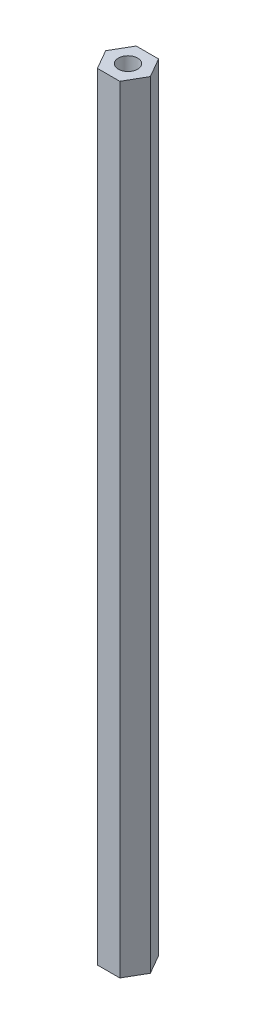
ISO-10303-21;
HEADER;
FILE_DESCRIPTION(('STEP AP214'),'2;1');
FILE_NAME('part.step','',(''),(''),'','','');
FILE_SCHEMA(('AUTOMOTIVE_DESIGN { 1 0 10303 214 1 1 1 1 }'));
ENDSEC;
DATA;
#1=APPLICATION_CONTEXT('core data for automotive mechanical design processes');
#2=APPLICATION_PROTOCOL_DEFINITION('international standard','automotive_design',2000,#1);
#3=PRODUCT_CONTEXT('',#1,'mechanical');
#4=PRODUCT('Part','Part','',(#3));
#5=PRODUCT_RELATED_PRODUCT_CATEGORY('part','',(#4));
#6=PRODUCT_DEFINITION_FORMATION('','',#4);
#7=PRODUCT_DEFINITION_CONTEXT('part definition',#1,'design');
#8=PRODUCT_DEFINITION('design','',#6,#7);
#9=PRODUCT_DEFINITION_SHAPE('','',#8);
#10=(LENGTH_UNIT() NAMED_UNIT(*) SI_UNIT(.MILLI.,.METRE.));
#11=(NAMED_UNIT(*) PLANE_ANGLE_UNIT() SI_UNIT($,.RADIAN.));
#12=(NAMED_UNIT(*) SI_UNIT($,.STERADIAN.) SOLID_ANGLE_UNIT());
#13=UNCERTAINTY_MEASURE_WITH_UNIT(LENGTH_MEASURE(1.E-05),#10,'distance_accuracy_value','');
#14=(GEOMETRIC_REPRESENTATION_CONTEXT(3) GLOBAL_UNCERTAINTY_ASSIGNED_CONTEXT((#13)) GLOBAL_UNIT_ASSIGNED_CONTEXT((#10,
#11,#12)) REPRESENTATION_CONTEXT('',''));
#15=CARTESIAN_POINT('',(0.,0.,0.));
#16=DIRECTION('',(0.,0.,1.));
#17=DIRECTION('',(1.,0.,0.));
#18=AXIS2_PLACEMENT_3D('',#15,#16,#17);
#19=CARTESIAN_POINT('',(1.44337567297409,50.1015,2.49999999999999));
#20=DIRECTION('',(-0.866025403784441,0.,-0.499999999999995));
#21=DIRECTION('',(-0.499999999999995,0.,0.866025403784441));
#22=AXIS2_PLACEMENT_3D('',#19,#20,#21);
#23=PLANE('',#22);
#24=DIRECTION('',(0.499999999999995,0.,-0.866025403784441));
#25=VECTOR('',#24,1.);
#26=CARTESIAN_POINT('',(1.44337567297409,-50.1015,2.49999999999999));
#27=LINE('',#26,#25);
#28=CARTESIAN_POINT('',(1.44337567297409,-50.1015,2.49999999999999));
#29=VERTEX_POINT('',#28);
#30=CARTESIAN_POINT('',(2.88675134594813,-50.1015,0.));
#31=VERTEX_POINT('',#30);
#32=EDGE_CURVE('E136',#29,#31,#27,.T.);
#33=ORIENTED_EDGE('',*,*,#32,.T.);
#34=DIRECTION('',(0.,-1.,0.));
#35=VECTOR('',#34,1.);
#36=CARTESIAN_POINT('',(2.88675134594813,50.1015,0.));
#37=LINE('',#36,#35);
#38=CARTESIAN_POINT('',(2.88675134594813,50.1015,0.));
#39=VERTEX_POINT('',#38);
#40=EDGE_CURVE('E11',#39,#31,#37,.T.);
#41=ORIENTED_EDGE('',*,*,#40,.F.);
#42=DIRECTION('',(0.499999999999995,0.,-0.866025403784441));
#43=VECTOR('',#42,1.);
#44=CARTESIAN_POINT('',(1.44337567297409,50.1015,2.49999999999999));
#45=LINE('',#44,#43);
#46=CARTESIAN_POINT('',(1.44337567297409,50.1015,2.49999999999999));
#47=VERTEX_POINT('',#46);
#48=EDGE_CURVE('E147',#47,#39,#45,.T.);
#49=ORIENTED_EDGE('',*,*,#48,.F.);
#50=DIRECTION('',(0.,-1.,0.));
#51=VECTOR('',#50,1.);
#52=CARTESIAN_POINT('',(1.44337567297409,50.1015,2.49999999999999));
#53=LINE('',#52,#51);
#54=EDGE_CURVE('E132',#47,#29,#53,.T.);
#55=ORIENTED_EDGE('',*,*,#54,.T.);
#56=EDGE_LOOP('',(#33,#41,#49,#55));
#57=FACE_BOUND('',#56,.T.);
#58=ADVANCED_FACE('F49',(#57),#23,.F.);
#59=CARTESIAN_POINT('',(2.88675134594813,50.1015,0.));
#60=DIRECTION('',(-0.866025403784438,0.,0.500000000000001));
#61=DIRECTION('',(0.500000000000001,0.,0.866025403784438));
#62=AXIS2_PLACEMENT_3D('',#59,#60,#61);
#63=PLANE('',#62);
#64=DIRECTION('',(-0.500000000000001,0.,-0.866025403784438));
#65=VECTOR('',#64,1.);
#66=CARTESIAN_POINT('',(2.88675134594813,-50.1015,0.));
#67=LINE('',#66,#65);
#68=CARTESIAN_POINT('',(1.44337567297406,-50.1015,-2.50000000000001));
#69=VERTEX_POINT('',#68);
#70=EDGE_CURVE('E139',#31,#69,#67,.T.);
#71=ORIENTED_EDGE('',*,*,#70,.T.);
#72=DIRECTION('',(0.,-1.,0.));
#73=VECTOR('',#72,1.);
#74=CARTESIAN_POINT('',(1.44337567297406,50.1015,-2.50000000000001));
#75=LINE('',#74,#73);
#76=CARTESIAN_POINT('',(1.44337567297406,50.1015,-2.50000000000001));
#77=VERTEX_POINT('',#76);
#78=EDGE_CURVE('E57',#77,#69,#75,.T.);
#79=ORIENTED_EDGE('',*,*,#78,.F.);
#80=DIRECTION('',(-0.500000000000001,0.,-0.866025403784438));
#81=VECTOR('',#80,1.);
#82=CARTESIAN_POINT('',(2.88675134594813,50.1015,0.));
#83=LINE('',#82,#81);
#84=EDGE_CURVE('E103',#39,#77,#83,.T.);
#85=ORIENTED_EDGE('',*,*,#84,.F.);
#86=ORIENTED_EDGE('',*,*,#40,.T.);
#87=EDGE_LOOP('',(#71,#79,#85,#86));
#88=FACE_BOUND('',#87,.T.);
#89=ADVANCED_FACE('F173',(#88),#63,.F.);
#90=CARTESIAN_POINT('',(1.44337567297406,50.1015,-2.50000000000001));
#91=DIRECTION('',(0.,0.,1.));
#92=DIRECTION('',(1.,0.,0.));
#93=AXIS2_PLACEMENT_3D('',#90,#91,#92);
#94=PLANE('',#93);
#95=DIRECTION('',(-1.,0.,0.));
#96=VECTOR('',#95,1.);
#97=CARTESIAN_POINT('',(1.44337567297406,-50.1015,-2.50000000000001));
#98=LINE('',#97,#96);
#99=CARTESIAN_POINT('',(-1.44337567297408,-50.1015,-2.5));
#100=VERTEX_POINT('',#99);
#101=EDGE_CURVE('E142',#69,#100,#98,.T.);
#102=ORIENTED_EDGE('',*,*,#101,.T.);
#103=DIRECTION('',(0.,-1.,0.));
#104=VECTOR('',#103,1.);
#105=CARTESIAN_POINT('',(-1.44337567297408,50.1015,-2.5));
#106=LINE('',#105,#104);
#107=CARTESIAN_POINT('',(-1.44337567297408,50.1015,-2.5));
#108=VERTEX_POINT('',#107);
#109=EDGE_CURVE('E127',#108,#100,#106,.T.);
#110=ORIENTED_EDGE('',*,*,#109,.F.);
#111=DIRECTION('',(-1.,0.,0.));
#112=VECTOR('',#111,1.);
#113=CARTESIAN_POINT('',(1.44337567297406,50.1015,-2.50000000000001));
#114=LINE('',#113,#112);
#115=EDGE_CURVE('E118',#77,#108,#114,.T.);
#116=ORIENTED_EDGE('',*,*,#115,.F.);
#117=ORIENTED_EDGE('',*,*,#78,.T.);
#118=EDGE_LOOP('',(#102,#110,#116,#117));
#119=FACE_BOUND('',#118,.T.);
#120=ADVANCED_FACE('F153',(#119),#94,.F.);
#121=CARTESIAN_POINT('',(-1.44337567297408,50.1015,-2.5));
#122=DIRECTION('',(0.866025403784442,0.,0.499999999999995));
#123=DIRECTION('',(0.499999999999995,0.,-0.866025403784442));
#124=AXIS2_PLACEMENT_3D('',#121,#122,#123);
#125=PLANE('',#124);
#126=DIRECTION('',(-0.499999999999995,0.,0.866025403784442));
#127=VECTOR('',#126,1.);
#128=CARTESIAN_POINT('',(-1.44337567297408,-50.1015,-2.5));
#129=LINE('',#128,#127);
#130=CARTESIAN_POINT('',(-2.88675134594813,-50.1015,0.));
#131=VERTEX_POINT('',#130);
#132=EDGE_CURVE('E126',#100,#131,#129,.T.);
#133=ORIENTED_EDGE('',*,*,#132,.T.);
#134=DIRECTION('',(0.,-1.,0.));
#135=VECTOR('',#134,1.);
#136=CARTESIAN_POINT('',(-2.88675134594813,50.1015,0.));
#137=LINE('',#136,#135);
#138=CARTESIAN_POINT('',(-2.88675134594813,50.1015,0.));
#139=VERTEX_POINT('',#138);
#140=EDGE_CURVE('E123',#139,#131,#137,.T.);
#141=ORIENTED_EDGE('',*,*,#140,.F.);
#142=DIRECTION('',(-0.499999999999995,0.,0.866025403784442));
#143=VECTOR('',#142,1.);
#144=CARTESIAN_POINT('',(-1.44337567297408,50.1015,-2.5));
#145=LINE('',#144,#143);
#146=EDGE_CURVE('E112',#108,#139,#145,.T.);
#147=ORIENTED_EDGE('',*,*,#146,.F.);
#148=ORIENTED_EDGE('',*,*,#109,.T.);
#149=EDGE_LOOP('',(#133,#141,#147,#148));
#150=FACE_BOUND('',#149,.T.);
#151=ADVANCED_FACE('F124',(#150),#125,.F.);
#152=CARTESIAN_POINT('',(-2.88675134594813,50.1015,0.));
#153=DIRECTION('',(0.866025403784435,0.,-0.500000000000007));
#154=DIRECTION('',(-0.500000000000007,0.,-0.866025403784435));
#155=AXIS2_PLACEMENT_3D('',#152,#153,#154);
#156=PLANE('',#155);
#157=DIRECTION('',(0.500000000000007,0.,0.866025403784434));
#158=VECTOR('',#157,1.);
#159=CARTESIAN_POINT('',(-2.88675134594813,-50.1015,0.));
#160=LINE('',#159,#158);
#161=CARTESIAN_POINT('',(-1.44337567297404,-50.1015,2.50000000000002));
#162=VERTEX_POINT('',#161);
#163=EDGE_CURVE('E89',#131,#162,#160,.T.);
#164=ORIENTED_EDGE('',*,*,#163,.T.);
#165=DIRECTION('',(0.,-1.,0.));
#166=VECTOR('',#165,1.);
#167=CARTESIAN_POINT('',(-1.44337567297404,50.1015,2.50000000000002));
#168=LINE('',#167,#166);
#169=CARTESIAN_POINT('',(-1.44337567297404,50.1015,2.50000000000002));
#170=VERTEX_POINT('',#169);
#171=EDGE_CURVE('E128',#170,#162,#168,.T.);
#172=ORIENTED_EDGE('',*,*,#171,.F.);
#173=DIRECTION('',(0.500000000000007,0.,0.866025403784434));
#174=VECTOR('',#173,1.);
#175=CARTESIAN_POINT('',(-2.88675134594813,50.1015,0.));
#176=LINE('',#175,#174);
#177=EDGE_CURVE('E116',#139,#170,#176,.T.);
#178=ORIENTED_EDGE('',*,*,#177,.F.);
#179=ORIENTED_EDGE('',*,*,#140,.T.);
#180=EDGE_LOOP('',(#164,#172,#178,#179));
#181=FACE_BOUND('',#180,.T.);
#182=ADVANCED_FACE('F130',(#181),#156,.F.);
#183=CARTESIAN_POINT('',(-1.44337567297404,50.1015,2.50000000000002));
#184=DIRECTION('',(0.,0.,-1.));
#185=DIRECTION('',(-1.,0.,0.));
#186=AXIS2_PLACEMENT_3D('',#183,#184,#185);
#187=PLANE('',#186);
#188=DIRECTION('',(1.,0.,0.));
#189=VECTOR('',#188,1.);
#190=CARTESIAN_POINT('',(-1.44337567297404,-50.1015,2.50000000000002));
#191=LINE('',#190,#189);
#192=EDGE_CURVE('E95',#162,#29,#191,.T.);
#193=ORIENTED_EDGE('',*,*,#192,.T.);
#194=ORIENTED_EDGE('',*,*,#54,.F.);
#195=DIRECTION('',(1.,0.,0.));
#196=VECTOR('',#195,1.);
#197=CARTESIAN_POINT('',(-1.44337567297404,50.1015,2.50000000000002));
#198=LINE('',#197,#196);
#199=EDGE_CURVE('E65',#170,#47,#198,.T.);
#200=ORIENTED_EDGE('',*,*,#199,.F.);
#201=ORIENTED_EDGE('',*,*,#171,.T.);
#202=EDGE_LOOP('',(#193,#194,#200,#201));
#203=FACE_BOUND('',#202,.T.);
#204=ADVANCED_FACE('F160',(#203),#187,.F.);
#205=CARTESIAN_POINT('',(0.,50.1015,0.));
#206=DIRECTION('',(0.,1.,0.));
#207=DIRECTION('',(0.,0.,1.));
#208=AXIS2_PLACEMENT_3D('',#205,#206,#207);
#209=PLANE('',#208);
#210=CARTESIAN_POINT('',(0.,50.1015,0.));
#211=DIRECTION('',(0.,1.,0.));
#212=DIRECTION('',(0.,0.,1.));
#213=AXIS2_PLACEMENT_3D('',#210,#211,#212);
#214=CIRCLE('',#213,1.24999999999999);
#215=CARTESIAN_POINT('',(0.,50.1015,1.24999999999999));
#216=VERTEX_POINT('',#215);
#217=EDGE_CURVE('E287',#216,#216,#214,.T.);
#218=ORIENTED_EDGE('',*,*,#217,.F.);
#219=EDGE_LOOP('',(#218));
#220=FACE_BOUND('',#219,.T.);
#221=ORIENTED_EDGE('',*,*,#48,.T.);
#222=ORIENTED_EDGE('',*,*,#84,.T.);
#223=ORIENTED_EDGE('',*,*,#115,.T.);
#224=ORIENTED_EDGE('',*,*,#146,.T.);
#225=ORIENTED_EDGE('',*,*,#177,.T.);
#226=ORIENTED_EDGE('',*,*,#199,.T.);
#227=EDGE_LOOP('',(#221,#222,#223,#224,#225,#226));
#228=FACE_BOUND('',#227,.T.);
#229=ADVANCED_FACE('F114',(#220,#228),#209,.T.);
#230=CARTESIAN_POINT('',(0.,-50.1015,0.));
#231=DIRECTION('',(0.,1.,0.));
#232=DIRECTION('',(0.,0.,1.));
#233=AXIS2_PLACEMENT_3D('',#230,#231,#232);
#234=PLANE('',#233);
#235=CARTESIAN_POINT('',(0.,-50.1015,0.));
#236=DIRECTION('',(0.,-1.,0.));
#237=DIRECTION('',(0.,0.,-1.));
#238=AXIS2_PLACEMENT_3D('',#235,#236,#237);
#239=CIRCLE('',#238,1.24999999999999);
#240=CARTESIAN_POINT('',(0.,-50.1015,-1.24999999999999));
#241=VERTEX_POINT('',#240);
#242=EDGE_CURVE('E285',#241,#241,#239,.T.);
#243=ORIENTED_EDGE('',*,*,#242,.F.);
#244=EDGE_LOOP('',(#243));
#245=FACE_BOUND('',#244,.T.);
#246=ORIENTED_EDGE('',*,*,#32,.F.);
#247=ORIENTED_EDGE('',*,*,#192,.F.);
#248=ORIENTED_EDGE('',*,*,#163,.F.);
#249=ORIENTED_EDGE('',*,*,#132,.F.);
#250=ORIENTED_EDGE('',*,*,#101,.F.);
#251=ORIENTED_EDGE('',*,*,#70,.F.);
#252=EDGE_LOOP('',(#246,#247,#248,#249,#250,#251));
#253=FACE_BOUND('',#252,.T.);
#254=ADVANCED_FACE('F156',(#245,#253),#234,.F.);
#255=CARTESIAN_POINT('',(0.,40.5765,0.));
#256=DIRECTION('',(0.,1.,0.));
#257=DIRECTION('',(0.,0.,1.));
#258=AXIS2_PLACEMENT_3D('',#255,#256,#257);
#259=CONICAL_SURFACE('',#258,1.24999999999999,1.02974425867665);
#260=CARTESIAN_POINT('',(0.,39.8254242262156,0.));
#261=VERTEX_POINT('',#260);
#262=VERTEX_LOOP('',#261);
#263=FACE_BOUND('',#262,.T.);
#264=CARTESIAN_POINT('',(0.,40.5765,0.));
#265=DIRECTION('',(0.,1.,0.));
#266=DIRECTION('',(0.,0.,1.));
#267=AXIS2_PLACEMENT_3D('',#264,#265,#266);
#268=CIRCLE('',#267,1.24999999999999);
#269=CARTESIAN_POINT('',(0.,40.5765,1.24999999999999));
#270=VERTEX_POINT('',#269);
#271=EDGE_CURVE('E140',#270,#270,#268,.T.);
#272=ORIENTED_EDGE('',*,*,#271,.T.);
#273=EDGE_LOOP('',(#272));
#274=FACE_BOUND('',#273,.T.);
#275=ADVANCED_FACE('F215',(#263,#274),#259,.F.);
#276=CARTESIAN_POINT('',(0.,50.1015,0.));
#277=DIRECTION('',(0.,1.,0.));
#278=DIRECTION('',(0.,0.,1.));
#279=AXIS2_PLACEMENT_3D('',#276,#277,#278);
#280=CYLINDRICAL_SURFACE('',#279,1.24999999999999);
#281=ORIENTED_EDGE('',*,*,#271,.F.);
#282=EDGE_LOOP('',(#281));
#283=FACE_BOUND('',#282,.T.);
#284=ORIENTED_EDGE('',*,*,#217,.T.);
#285=EDGE_LOOP('',(#284));
#286=FACE_BOUND('',#285,.T.);
#287=ADVANCED_FACE('F226',(#283,#286),#280,.F.);
#288=CARTESIAN_POINT('',(0.,-40.5765,0.));
#289=DIRECTION('',(0.,-1.,0.));
#290=DIRECTION('',(0.,0.,-1.));
#291=AXIS2_PLACEMENT_3D('',#288,#289,#290);
#292=CONICAL_SURFACE('',#291,1.24999999999999,1.02974425867665);
#293=CARTESIAN_POINT('',(0.,-39.8254242262156,0.));
#294=VERTEX_POINT('',#293);
#295=VERTEX_LOOP('',#294);
#296=FACE_BOUND('',#295,.T.);
#297=CARTESIAN_POINT('',(0.,-40.5765,0.));
#298=DIRECTION('',(0.,-1.,0.));
#299=DIRECTION('',(0.,0.,-1.));
#300=AXIS2_PLACEMENT_3D('',#297,#298,#299);
#301=CIRCLE('',#300,1.24999999999999);
#302=CARTESIAN_POINT('',(0.,-40.5765,-1.24999999999999));
#303=VERTEX_POINT('',#302);
#304=EDGE_CURVE('E282',#303,#303,#301,.T.);
#305=ORIENTED_EDGE('',*,*,#304,.T.);
#306=EDGE_LOOP('',(#305));
#307=FACE_BOUND('',#306,.T.);
#308=ADVANCED_FACE('F236',(#296,#307),#292,.F.);
#309=CARTESIAN_POINT('',(0.,-50.1015,0.));
#310=DIRECTION('',(0.,-1.,0.));
#311=DIRECTION('',(0.,0.,-1.));
#312=AXIS2_PLACEMENT_3D('',#309,#310,#311);
#313=CYLINDRICAL_SURFACE('',#312,1.24999999999999);
#314=ORIENTED_EDGE('',*,*,#304,.F.);
#315=EDGE_LOOP('',(#314));
#316=FACE_BOUND('',#315,.T.);
#317=ORIENTED_EDGE('',*,*,#242,.T.);
#318=EDGE_LOOP('',(#317));
#319=FACE_BOUND('',#318,.T.);
#320=ADVANCED_FACE('F246',(#316,#319),#313,.F.);
#321=CLOSED_SHELL('',(#58,#89,#120,#151,#182,#204,#229,#254,#275,#287,#308,#320));
#322=MANIFOLD_SOLID_BREP('B2',#321);
#323=ADVANCED_BREP_SHAPE_REPRESENTATION('',(#18,#322),#14);
#324=SHAPE_DEFINITION_REPRESENTATION(#9,#323);
ENDSEC;
END-ISO-10303-21;
